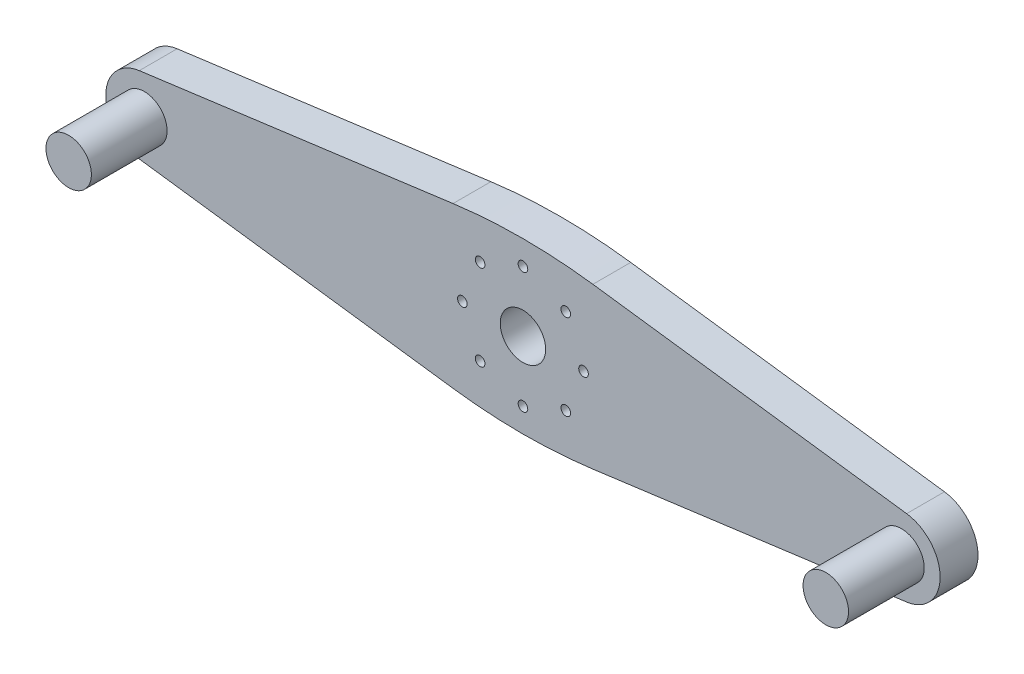
ISO-10303-21;
HEADER;
FILE_DESCRIPTION(('STEP AP214'),'2;1');
FILE_NAME('part.step','',(''),(''),'','','');
FILE_SCHEMA(('AUTOMOTIVE_DESIGN { 1 0 10303 214 1 1 1 1 }'));
ENDSEC;
DATA;
#1=APPLICATION_CONTEXT('core data for automotive mechanical design processes');
#2=APPLICATION_PROTOCOL_DEFINITION('international standard','automotive_design',2000,#1);
#3=PRODUCT_CONTEXT('',#1,'mechanical');
#4=PRODUCT('Part','Part','',(#3));
#5=PRODUCT_RELATED_PRODUCT_CATEGORY('part','',(#4));
#6=PRODUCT_DEFINITION_FORMATION('','',#4);
#7=PRODUCT_DEFINITION_CONTEXT('part definition',#1,'design');
#8=PRODUCT_DEFINITION('design','',#6,#7);
#9=PRODUCT_DEFINITION_SHAPE('','',#8);
#10=(LENGTH_UNIT() NAMED_UNIT(*) SI_UNIT(.MILLI.,.METRE.));
#11=(NAMED_UNIT(*) PLANE_ANGLE_UNIT() SI_UNIT($,.RADIAN.));
#12=(NAMED_UNIT(*) SI_UNIT($,.STERADIAN.) SOLID_ANGLE_UNIT());
#13=UNCERTAINTY_MEASURE_WITH_UNIT(LENGTH_MEASURE(1.E-05),#10,'distance_accuracy_value','');
#14=(GEOMETRIC_REPRESENTATION_CONTEXT(3) GLOBAL_UNCERTAINTY_ASSIGNED_CONTEXT((#13)) GLOBAL_UNIT_ASSIGNED_CONTEXT((#10,
#11,#12)) REPRESENTATION_CONTEXT('',''));
#15=CARTESIAN_POINT('',(0.,0.,0.));
#16=DIRECTION('',(0.,0.,1.));
#17=DIRECTION('',(1.,0.,0.));
#18=AXIS2_PLACEMENT_3D('',#15,#16,#17);
#19=CARTESIAN_POINT('',(50.,0.,5.));
#20=DIRECTION('',(0.,0.,-1.));
#21=DIRECTION('',(-1.,0.,0.));
#22=AXIS2_PLACEMENT_3D('',#19,#20,#21);
#23=PLANE('',#22);
#24=CARTESIAN_POINT('',(50.,0.,5.));
#25=DIRECTION('',(0.,0.,1.));
#26=DIRECTION('',(-1.,0.,0.));
#27=AXIS2_PLACEMENT_3D('',#24,#25,#26);
#28=CIRCLE('',#27,5.10024633771241);
#29=CARTESIAN_POINT('',(50.6728763500851,-5.05566515137672,5.));
#30=VERTEX_POINT('',#29);
#31=CARTESIAN_POINT('',(50.6728763500851,5.05566515137672,5.));
#32=VERTEX_POINT('',#31);
#33=EDGE_CURVE('E147',#30,#32,#28,.T.);
#34=ORIENTED_EDGE('',*,*,#33,.T.);
#35=DIRECTION('',(-0.991259013117456,0.131930166805804,0.));
#36=VECTOR('',#35,1.);
#37=CARTESIAN_POINT('',(50.6728763500851,5.05566515137672,5.));
#38=LINE('',#37,#36);
#39=CARTESIAN_POINT('',(9.2351116764065,10.5707637614413,5.));
#40=VERTEX_POINT('',#39);
#41=EDGE_CURVE('E95',#32,#40,#38,.T.);
#42=ORIENTED_EDGE('',*,*,#41,.T.);
#43=CARTESIAN_POINT('',(0.,-58.8173671567806,5.));
#44=DIRECTION('',(0.,0.,1.));
#45=DIRECTION('',(-1.,0.,0.));
#46=AXIS2_PLACEMENT_3D('',#43,#44,#45);
#47=CIRCLE('',#46,70.);
#48=CARTESIAN_POINT('',(-9.23511167640649,10.5707637614413,5.));
#49=VERTEX_POINT('',#48);
#50=EDGE_CURVE('E162',#40,#49,#47,.T.);
#51=ORIENTED_EDGE('',*,*,#50,.T.);
#52=DIRECTION('',(-0.991259013117456,-0.131930166805804,0.));
#53=VECTOR('',#52,1.);
#54=CARTESIAN_POINT('',(-50.6728763500851,5.05566515137672,5.));
#55=LINE('',#54,#53);
#56=CARTESIAN_POINT('',(-50.6728763500851,5.05566515137672,5.));
#57=VERTEX_POINT('',#56);
#58=EDGE_CURVE('E175',#49,#57,#55,.T.);
#59=ORIENTED_EDGE('',*,*,#58,.T.);
#60=CARTESIAN_POINT('',(-50.,0.,5.));
#61=DIRECTION('',(0.,0.,1.));
#62=DIRECTION('',(1.,0.,0.));
#63=AXIS2_PLACEMENT_3D('',#60,#61,#62);
#64=CIRCLE('',#63,5.10024633771241);
#65=CARTESIAN_POINT('',(-50.6728763500851,-5.05566515137672,5.));
#66=VERTEX_POINT('',#65);
#67=EDGE_CURVE('E114',#57,#66,#64,.T.);
#68=ORIENTED_EDGE('',*,*,#67,.T.);
#69=DIRECTION('',(0.991259013117456,-0.131930166805804,0.));
#70=VECTOR('',#69,1.);
#71=CARTESIAN_POINT('',(-50.6728763500851,-5.05566515137672,5.));
#72=LINE('',#71,#70);
#73=CARTESIAN_POINT('',(-9.23511167640653,-10.5707637614413,5.));
#74=VERTEX_POINT('',#73);
#75=EDGE_CURVE('E108',#66,#74,#72,.T.);
#76=ORIENTED_EDGE('',*,*,#75,.T.);
#77=CARTESIAN_POINT('',(0.,58.8173671567806,5.));
#78=DIRECTION('',(0.,0.,1.));
#79=DIRECTION('',(1.,0.,0.));
#80=AXIS2_PLACEMENT_3D('',#77,#78,#79);
#81=CIRCLE('',#80,70.);
#82=CARTESIAN_POINT('',(9.23511167640649,-10.5707637614413,5.));
#83=VERTEX_POINT('',#82);
#84=EDGE_CURVE('E112',#74,#83,#81,.T.);
#85=ORIENTED_EDGE('',*,*,#84,.T.);
#86=DIRECTION('',(0.991259013117456,0.131930166805804,0.));
#87=VECTOR('',#86,1.);
#88=CARTESIAN_POINT('',(50.6728763500851,-5.05566515137672,5.));
#89=LINE('',#88,#87);
#90=EDGE_CURVE('E52',#83,#30,#89,.T.);
#91=ORIENTED_EDGE('',*,*,#90,.T.);
#92=EDGE_LOOP('',(#34,#42,#51,#59,#68,#76,#85,#91));
#93=FACE_BOUND('',#92,.T.);
#94=CARTESIAN_POINT('',(0.,0.,5.));
#95=DIRECTION('',(0.,0.,1.));
#96=DIRECTION('',(1.,0.,0.));
#97=AXIS2_PLACEMENT_3D('',#94,#95,#96);
#98=CIRCLE('',#97,3.);
#99=CARTESIAN_POINT('',(3.,0.,5.));
#100=VERTEX_POINT('',#99);
#101=EDGE_CURVE('E136',#100,#100,#98,.T.);
#102=ORIENTED_EDGE('',*,*,#101,.F.);
#103=EDGE_LOOP('',(#102));
#104=FACE_BOUND('',#103,.T.);
#105=CARTESIAN_POINT('',(-8.,0.,5.));
#106=DIRECTION('',(0.,0.,1.));
#107=DIRECTION('',(1.,0.,0.));
#108=AXIS2_PLACEMENT_3D('',#105,#106,#107);
#109=CIRCLE('',#108,0.635000000000001);
#110=CARTESIAN_POINT('',(-7.365,0.,5.));
#111=VERTEX_POINT('',#110);
#112=EDGE_CURVE('E184',#111,#111,#109,.T.);
#113=ORIENTED_EDGE('',*,*,#112,.F.);
#114=EDGE_LOOP('',(#113));
#115=FACE_BOUND('',#114,.T.);
#116=CARTESIAN_POINT('',(-50.,0.,5.));
#117=DIRECTION('',(0.,0.,1.));
#118=DIRECTION('',(1.,0.,0.));
#119=AXIS2_PLACEMENT_3D('',#116,#117,#118);
#120=CIRCLE('',#119,3.);
#121=CARTESIAN_POINT('',(-47.,0.,5.));
#122=VERTEX_POINT('',#121);
#123=EDGE_CURVE('E190',#122,#122,#120,.T.);
#124=ORIENTED_EDGE('',*,*,#123,.F.);
#125=EDGE_LOOP('',(#124));
#126=FACE_BOUND('',#125,.T.);
#127=CARTESIAN_POINT('',(-5.65685424949237,5.65685424949239,5.));
#128=DIRECTION('',(0.,0.,1.));
#129=DIRECTION('',(1.,0.,0.));
#130=AXIS2_PLACEMENT_3D('',#127,#128,#129);
#131=CIRCLE('',#130,0.635000000000001);
#132=CARTESIAN_POINT('',(-5.02185424949237,5.65685424949239,5.));
#133=VERTEX_POINT('',#132);
#134=EDGE_CURVE('E195',#133,#133,#131,.T.);
#135=ORIENTED_EDGE('',*,*,#134,.F.);
#136=EDGE_LOOP('',(#135));
#137=FACE_BOUND('',#136,.T.);
#138=CARTESIAN_POINT('',(0.,8.,5.));
#139=DIRECTION('',(0.,0.,1.));
#140=DIRECTION('',(1.,0.,0.));
#141=AXIS2_PLACEMENT_3D('',#138,#139,#140);
#142=CIRCLE('',#141,0.635000000000001);
#143=CARTESIAN_POINT('',(0.63500000000003,8.,5.));
#144=VERTEX_POINT('',#143);
#145=EDGE_CURVE('E199',#144,#144,#142,.T.);
#146=ORIENTED_EDGE('',*,*,#145,.F.);
#147=EDGE_LOOP('',(#146));
#148=FACE_BOUND('',#147,.T.);
#149=CARTESIAN_POINT('',(50.,0.,5.));
#150=DIRECTION('',(0.,0.,1.));
#151=DIRECTION('',(-1.,0.,0.));
#152=AXIS2_PLACEMENT_3D('',#149,#150,#151);
#153=CIRCLE('',#152,3.);
#154=CARTESIAN_POINT('',(47.,0.,5.));
#155=VERTEX_POINT('',#154);
#156=EDGE_CURVE('E205',#155,#155,#153,.T.);
#157=ORIENTED_EDGE('',*,*,#156,.F.);
#158=EDGE_LOOP('',(#157));
#159=FACE_BOUND('',#158,.T.);
#160=CARTESIAN_POINT('',(5.65685424949241,5.65685424949235,5.));
#161=DIRECTION('',(0.,0.,1.));
#162=DIRECTION('',(1.,0.,0.));
#163=AXIS2_PLACEMENT_3D('',#160,#161,#162);
#164=CIRCLE('',#163,0.635);
#165=CARTESIAN_POINT('',(6.29185424949241,5.65685424949235,5.));
#166=VERTEX_POINT('',#165);
#167=EDGE_CURVE('E210',#166,#166,#164,.T.);
#168=ORIENTED_EDGE('',*,*,#167,.F.);
#169=EDGE_LOOP('',(#168));
#170=FACE_BOUND('',#169,.T.);
#171=CARTESIAN_POINT('',(8.,0.,5.));
#172=DIRECTION('',(0.,0.,1.));
#173=DIRECTION('',(1.,0.,0.));
#174=AXIS2_PLACEMENT_3D('',#171,#172,#173);
#175=CIRCLE('',#174,0.635);
#176=CARTESIAN_POINT('',(8.635,0.,5.));
#177=VERTEX_POINT('',#176);
#178=EDGE_CURVE('E214',#177,#177,#175,.T.);
#179=ORIENTED_EDGE('',*,*,#178,.F.);
#180=EDGE_LOOP('',(#179));
#181=FACE_BOUND('',#180,.T.);
#182=CARTESIAN_POINT('',(5.65685424949233,-5.65685424949243,5.));
#183=DIRECTION('',(0.,0.,1.));
#184=DIRECTION('',(1.,0.,0.));
#185=AXIS2_PLACEMENT_3D('',#182,#183,#184);
#186=CIRCLE('',#185,0.635000000000001);
#187=CARTESIAN_POINT('',(6.29185424949233,-5.65685424949243,5.));
#188=VERTEX_POINT('',#187);
#189=EDGE_CURVE('E220',#188,#188,#186,.T.);
#190=ORIENTED_EDGE('',*,*,#189,.F.);
#191=EDGE_LOOP('',(#190));
#192=FACE_BOUND('',#191,.T.);
#193=CARTESIAN_POINT('',(0.,-8.,5.));
#194=DIRECTION('',(0.,0.,1.));
#195=DIRECTION('',(1.,0.,0.));
#196=AXIS2_PLACEMENT_3D('',#193,#194,#195);
#197=CIRCLE('',#196,0.635);
#198=CARTESIAN_POINT('',(0.634999999999915,-8.,5.));
#199=VERTEX_POINT('',#198);
#200=EDGE_CURVE('E226',#199,#199,#197,.T.);
#201=ORIENTED_EDGE('',*,*,#200,.F.);
#202=EDGE_LOOP('',(#201));
#203=FACE_BOUND('',#202,.T.);
#204=CARTESIAN_POINT('',(-5.65685424949245,-5.65685424949231,5.));
#205=DIRECTION('',(0.,0.,1.));
#206=DIRECTION('',(1.,0.,0.));
#207=AXIS2_PLACEMENT_3D('',#204,#205,#206);
#208=CIRCLE('',#207,0.635);
#209=CARTESIAN_POINT('',(-5.02185424949245,-5.65685424949231,5.));
#210=VERTEX_POINT('',#209);
#211=EDGE_CURVE('E232',#210,#210,#208,.T.);
#212=ORIENTED_EDGE('',*,*,#211,.F.);
#213=EDGE_LOOP('',(#212));
#214=FACE_BOUND('',#213,.T.);
#215=ADVANCED_FACE('F35',(#93,#104,#115,#126,#137,#148,#159,#170,#181,#192,#203,#214),#23,.F.);
#216=CARTESIAN_POINT('',(50.,0.,0.));
#217=DIRECTION('',(0.,0.,-1.));
#218=DIRECTION('',(-1.,0.,0.));
#219=AXIS2_PLACEMENT_3D('',#216,#217,#218);
#220=PLANE('',#219);
#221=CARTESIAN_POINT('',(0.,-8.,0.));
#222=DIRECTION('',(0.,0.,1.));
#223=DIRECTION('',(1.,0.,0.));
#224=AXIS2_PLACEMENT_3D('',#221,#222,#223);
#225=CIRCLE('',#224,0.635);
#226=CARTESIAN_POINT('',(0.634999999999915,-8.,0.));
#227=VERTEX_POINT('',#226);
#228=EDGE_CURVE('E229',#227,#227,#225,.T.);
#229=ORIENTED_EDGE('',*,*,#228,.T.);
#230=EDGE_LOOP('',(#229));
#231=FACE_BOUND('',#230,.T.);
#232=CARTESIAN_POINT('',(8.,0.,0.));
#233=DIRECTION('',(0.,0.,1.));
#234=DIRECTION('',(1.,0.,0.));
#235=AXIS2_PLACEMENT_3D('',#232,#233,#234);
#236=CIRCLE('',#235,0.635);
#237=CARTESIAN_POINT('',(8.635,0.,0.));
#238=VERTEX_POINT('',#237);
#239=EDGE_CURVE('E217',#238,#238,#236,.T.);
#240=ORIENTED_EDGE('',*,*,#239,.T.);
#241=EDGE_LOOP('',(#240));
#242=FACE_BOUND('',#241,.T.);
#243=CARTESIAN_POINT('',(-5.65685424949237,5.65685424949239,0.));
#244=DIRECTION('',(0.,0.,1.));
#245=DIRECTION('',(1.,0.,0.));
#246=AXIS2_PLACEMENT_3D('',#243,#244,#245);
#247=CIRCLE('',#246,0.635000000000001);
#248=CARTESIAN_POINT('',(-5.02185424949237,5.65685424949239,0.));
#249=VERTEX_POINT('',#248);
#250=EDGE_CURVE('E196',#249,#249,#247,.T.);
#251=ORIENTED_EDGE('',*,*,#250,.T.);
#252=EDGE_LOOP('',(#251));
#253=FACE_BOUND('',#252,.T.);
#254=CARTESIAN_POINT('',(-8.,0.,0.));
#255=DIRECTION('',(0.,0.,1.));
#256=DIRECTION('',(1.,0.,0.));
#257=AXIS2_PLACEMENT_3D('',#254,#255,#256);
#258=CIRCLE('',#257,0.635000000000001);
#259=CARTESIAN_POINT('',(-7.365,0.,0.));
#260=VERTEX_POINT('',#259);
#261=EDGE_CURVE('E187',#260,#260,#258,.T.);
#262=ORIENTED_EDGE('',*,*,#261,.T.);
#263=EDGE_LOOP('',(#262));
#264=FACE_BOUND('',#263,.T.);
#265=CARTESIAN_POINT('',(50.,0.,0.));
#266=DIRECTION('',(0.,0.,1.));
#267=DIRECTION('',(-1.,0.,0.));
#268=AXIS2_PLACEMENT_3D('',#265,#266,#267);
#269=CIRCLE('',#268,5.10024633771241);
#270=CARTESIAN_POINT('',(50.6728763500851,-5.05566515137672,0.));
#271=VERTEX_POINT('',#270);
#272=CARTESIAN_POINT('',(50.6728763500851,5.05566515137672,0.));
#273=VERTEX_POINT('',#272);
#274=EDGE_CURVE('E132',#271,#273,#269,.T.);
#275=ORIENTED_EDGE('',*,*,#274,.F.);
#276=DIRECTION('',(0.991259013117456,0.131930166805804,0.));
#277=VECTOR('',#276,1.);
#278=CARTESIAN_POINT('',(50.6728763500851,-5.05566515137672,0.));
#279=LINE('',#278,#277);
#280=CARTESIAN_POINT('',(9.23511167640649,-10.5707637614413,0.));
#281=VERTEX_POINT('',#280);
#282=EDGE_CURVE('E87',#281,#271,#279,.T.);
#283=ORIENTED_EDGE('',*,*,#282,.F.);
#284=CARTESIAN_POINT('',(0.,58.8173671567806,0.));
#285=DIRECTION('',(0.,0.,1.));
#286=DIRECTION('',(1.,0.,0.));
#287=AXIS2_PLACEMENT_3D('',#284,#285,#286);
#288=CIRCLE('',#287,70.);
#289=CARTESIAN_POINT('',(-9.23511167640653,-10.5707637614413,0.));
#290=VERTEX_POINT('',#289);
#291=EDGE_CURVE('E81',#290,#281,#288,.T.);
#292=ORIENTED_EDGE('',*,*,#291,.F.);
#293=DIRECTION('',(0.991259013117456,-0.131930166805804,0.));
#294=VECTOR('',#293,1.);
#295=CARTESIAN_POINT('',(-50.6728763500851,-5.05566515137672,0.));
#296=LINE('',#295,#294);
#297=CARTESIAN_POINT('',(-50.6728763500851,-5.05566515137672,0.));
#298=VERTEX_POINT('',#297);
#299=EDGE_CURVE('E122',#298,#290,#296,.T.);
#300=ORIENTED_EDGE('',*,*,#299,.F.);
#301=CARTESIAN_POINT('',(-50.,0.,0.));
#302=DIRECTION('',(0.,0.,1.));
#303=DIRECTION('',(1.,0.,0.));
#304=AXIS2_PLACEMENT_3D('',#301,#302,#303);
#305=CIRCLE('',#304,5.10024633771241);
#306=CARTESIAN_POINT('',(-50.6728763500851,5.05566515137672,0.));
#307=VERTEX_POINT('',#306);
#308=EDGE_CURVE('E142',#307,#298,#305,.T.);
#309=ORIENTED_EDGE('',*,*,#308,.F.);
#310=DIRECTION('',(-0.991259013117456,-0.131930166805804,0.));
#311=VECTOR('',#310,1.);
#312=CARTESIAN_POINT('',(-50.6728763500851,5.05566515137672,0.));
#313=LINE('',#312,#311);
#314=CARTESIAN_POINT('',(-9.23511167640649,10.5707637614413,0.));
#315=VERTEX_POINT('',#314);
#316=EDGE_CURVE('E140',#315,#307,#313,.T.);
#317=ORIENTED_EDGE('',*,*,#316,.F.);
#318=CARTESIAN_POINT('',(0.,-58.8173671567806,0.));
#319=DIRECTION('',(0.,0.,1.));
#320=DIRECTION('',(-1.,0.,0.));
#321=AXIS2_PLACEMENT_3D('',#318,#319,#320);
#322=CIRCLE('',#321,70.);
#323=CARTESIAN_POINT('',(9.2351116764065,10.5707637614413,0.));
#324=VERTEX_POINT('',#323);
#325=EDGE_CURVE('E138',#324,#315,#322,.T.);
#326=ORIENTED_EDGE('',*,*,#325,.F.);
#327=DIRECTION('',(-0.991259013117456,0.131930166805804,0.));
#328=VECTOR('',#327,1.);
#329=CARTESIAN_POINT('',(50.6728763500851,5.05566515137672,0.));
#330=LINE('',#329,#328);
#331=EDGE_CURVE('E135',#273,#324,#330,.T.);
#332=ORIENTED_EDGE('',*,*,#331,.F.);
#333=EDGE_LOOP('',(#275,#283,#292,#300,#309,#317,#326,#332));
#334=FACE_BOUND('',#333,.T.);
#335=CARTESIAN_POINT('',(0.,0.,0.));
#336=DIRECTION('',(0.,0.,1.));
#337=DIRECTION('',(1.,0.,0.));
#338=AXIS2_PLACEMENT_3D('',#335,#336,#337);
#339=CIRCLE('',#338,3.);
#340=CARTESIAN_POINT('',(3.,0.,0.));
#341=VERTEX_POINT('',#340);
#342=EDGE_CURVE('E181',#341,#341,#339,.T.);
#343=ORIENTED_EDGE('',*,*,#342,.T.);
#344=EDGE_LOOP('',(#343));
#345=FACE_BOUND('',#344,.T.);
#346=CARTESIAN_POINT('',(0.,8.,0.));
#347=DIRECTION('',(0.,0.,1.));
#348=DIRECTION('',(1.,0.,0.));
#349=AXIS2_PLACEMENT_3D('',#346,#347,#348);
#350=CIRCLE('',#349,0.635000000000001);
#351=CARTESIAN_POINT('',(0.63500000000003,8.,0.));
#352=VERTEX_POINT('',#351);
#353=EDGE_CURVE('E202',#352,#352,#350,.T.);
#354=ORIENTED_EDGE('',*,*,#353,.T.);
#355=EDGE_LOOP('',(#354));
#356=FACE_BOUND('',#355,.T.);
#357=CARTESIAN_POINT('',(5.65685424949241,5.65685424949235,0.));
#358=DIRECTION('',(0.,0.,1.));
#359=DIRECTION('',(1.,0.,0.));
#360=AXIS2_PLACEMENT_3D('',#357,#358,#359);
#361=CIRCLE('',#360,0.635);
#362=CARTESIAN_POINT('',(6.29185424949241,5.65685424949235,0.));
#363=VERTEX_POINT('',#362);
#364=EDGE_CURVE('E211',#363,#363,#361,.T.);
#365=ORIENTED_EDGE('',*,*,#364,.T.);
#366=EDGE_LOOP('',(#365));
#367=FACE_BOUND('',#366,.T.);
#368=CARTESIAN_POINT('',(5.65685424949233,-5.65685424949243,0.));
#369=DIRECTION('',(0.,0.,1.));
#370=DIRECTION('',(1.,0.,0.));
#371=AXIS2_PLACEMENT_3D('',#368,#369,#370);
#372=CIRCLE('',#371,0.635000000000001);
#373=CARTESIAN_POINT('',(6.29185424949233,-5.65685424949243,0.));
#374=VERTEX_POINT('',#373);
#375=EDGE_CURVE('E223',#374,#374,#372,.T.);
#376=ORIENTED_EDGE('',*,*,#375,.T.);
#377=EDGE_LOOP('',(#376));
#378=FACE_BOUND('',#377,.T.);
#379=CARTESIAN_POINT('',(-5.65685424949245,-5.65685424949231,0.));
#380=DIRECTION('',(0.,0.,1.));
#381=DIRECTION('',(1.,0.,0.));
#382=AXIS2_PLACEMENT_3D('',#379,#380,#381);
#383=CIRCLE('',#382,0.635);
#384=CARTESIAN_POINT('',(-5.02185424949245,-5.65685424949231,0.));
#385=VERTEX_POINT('',#384);
#386=EDGE_CURVE('E235',#385,#385,#383,.T.);
#387=ORIENTED_EDGE('',*,*,#386,.T.);
#388=EDGE_LOOP('',(#387));
#389=FACE_BOUND('',#388,.T.);
#390=ADVANCED_FACE('F166',(#231,#242,#253,#264,#334,#345,#356,#367,#378,#389),#220,.T.);
#391=CARTESIAN_POINT('',(50.,0.,5.));
#392=DIRECTION('',(0.,0.,-1.));
#393=DIRECTION('',(-1.,0.,0.));
#394=AXIS2_PLACEMENT_3D('',#391,#392,#393);
#395=CYLINDRICAL_SURFACE('',#394,5.10024633771241);
#396=ORIENTED_EDGE('',*,*,#274,.T.);
#397=DIRECTION('',(0.,0.,-1.));
#398=VECTOR('',#397,1.);
#399=CARTESIAN_POINT('',(50.6728763500851,5.05566515137672,5.));
#400=LINE('',#399,#398);
#401=EDGE_CURVE('E11',#32,#273,#400,.T.);
#402=ORIENTED_EDGE('',*,*,#401,.F.);
#403=ORIENTED_EDGE('',*,*,#33,.F.);
#404=DIRECTION('',(0.,0.,-1.));
#405=VECTOR('',#404,1.);
#406=CARTESIAN_POINT('',(50.6728763500851,-5.05566515137672,5.));
#407=LINE('',#406,#405);
#408=EDGE_CURVE('E128',#30,#271,#407,.T.);
#409=ORIENTED_EDGE('',*,*,#408,.T.);
#410=EDGE_LOOP('',(#396,#402,#403,#409));
#411=FACE_BOUND('',#410,.T.);
#412=ADVANCED_FACE('F37',(#411),#395,.T.);
#413=CARTESIAN_POINT('',(50.6728763500851,5.05566515137672,5.));
#414=DIRECTION('',(-0.131930166805804,-0.991259013117456,0.));
#415=DIRECTION('',(0.991259013117456,-0.131930166805804,0.));
#416=AXIS2_PLACEMENT_3D('',#413,#414,#415);
#417=PLANE('',#416);
#418=ORIENTED_EDGE('',*,*,#331,.T.);
#419=DIRECTION('',(0.,0.,-1.));
#420=VECTOR('',#419,1.);
#421=CARTESIAN_POINT('',(9.2351116764065,10.5707637614413,5.));
#422=LINE('',#421,#420);
#423=EDGE_CURVE('E44',#40,#324,#422,.T.);
#424=ORIENTED_EDGE('',*,*,#423,.F.);
#425=ORIENTED_EDGE('',*,*,#41,.F.);
#426=ORIENTED_EDGE('',*,*,#401,.T.);
#427=EDGE_LOOP('',(#418,#424,#425,#426));
#428=FACE_BOUND('',#427,.T.);
#429=ADVANCED_FACE('F281',(#428),#417,.F.);
#430=CARTESIAN_POINT('',(0.,-58.8173671567806,5.));
#431=DIRECTION('',(0.,0.,-1.));
#432=DIRECTION('',(-1.,0.,0.));
#433=AXIS2_PLACEMENT_3D('',#430,#431,#432);
#434=CYLINDRICAL_SURFACE('',#433,70.);
#435=ORIENTED_EDGE('',*,*,#325,.T.);
#436=DIRECTION('',(0.,0.,-1.));
#437=VECTOR('',#436,1.);
#438=CARTESIAN_POINT('',(-9.23511167640649,10.5707637614413,5.));
#439=LINE('',#438,#437);
#440=EDGE_CURVE('E154',#49,#315,#439,.T.);
#441=ORIENTED_EDGE('',*,*,#440,.F.);
#442=ORIENTED_EDGE('',*,*,#50,.F.);
#443=ORIENTED_EDGE('',*,*,#423,.T.);
#444=EDGE_LOOP('',(#435,#441,#442,#443));
#445=FACE_BOUND('',#444,.T.);
#446=ADVANCED_FACE('F160',(#445),#434,.T.);
#447=CARTESIAN_POINT('',(-50.6728763500851,5.05566515137672,5.));
#448=DIRECTION('',(0.131930166805804,-0.991259013117456,0.));
#449=DIRECTION('',(0.991259013117456,0.131930166805804,0.));
#450=AXIS2_PLACEMENT_3D('',#447,#448,#449);
#451=PLANE('',#450);
#452=ORIENTED_EDGE('',*,*,#316,.T.);
#453=DIRECTION('',(0.,0.,-1.));
#454=VECTOR('',#453,1.);
#455=CARTESIAN_POINT('',(-50.6728763500851,5.05566515137672,5.));
#456=LINE('',#455,#454);
#457=EDGE_CURVE('E151',#57,#307,#456,.T.);
#458=ORIENTED_EDGE('',*,*,#457,.F.);
#459=ORIENTED_EDGE('',*,*,#58,.F.);
#460=ORIENTED_EDGE('',*,*,#440,.T.);
#461=EDGE_LOOP('',(#452,#458,#459,#460));
#462=FACE_BOUND('',#461,.T.);
#463=ADVANCED_FACE('F171',(#462),#451,.F.);
#464=CARTESIAN_POINT('',(-50.,0.,5.));
#465=DIRECTION('',(0.,0.,-1.));
#466=DIRECTION('',(-1.,0.,0.));
#467=AXIS2_PLACEMENT_3D('',#464,#465,#466);
#468=CYLINDRICAL_SURFACE('',#467,5.10024633771241);
#469=ORIENTED_EDGE('',*,*,#308,.T.);
#470=DIRECTION('',(0.,0.,-1.));
#471=VECTOR('',#470,1.);
#472=CARTESIAN_POINT('',(-50.6728763500851,-5.05566515137672,5.));
#473=LINE('',#472,#471);
#474=EDGE_CURVE('E123',#66,#298,#473,.T.);
#475=ORIENTED_EDGE('',*,*,#474,.F.);
#476=ORIENTED_EDGE('',*,*,#67,.F.);
#477=ORIENTED_EDGE('',*,*,#457,.T.);
#478=EDGE_LOOP('',(#469,#475,#476,#477));
#479=FACE_BOUND('',#478,.T.);
#480=ADVANCED_FACE('F174',(#479),#468,.T.);
#481=CARTESIAN_POINT('',(-50.6728763500851,-5.05566515137672,5.));
#482=DIRECTION('',(0.131930166805804,0.991259013117456,0.));
#483=DIRECTION('',(-0.991259013117456,0.131930166805804,0.));
#484=AXIS2_PLACEMENT_3D('',#481,#482,#483);
#485=PLANE('',#484);
#486=ORIENTED_EDGE('',*,*,#299,.T.);
#487=DIRECTION('',(0.,0.,-1.));
#488=VECTOR('',#487,1.);
#489=CARTESIAN_POINT('',(-9.23511167640653,-10.5707637614413,5.));
#490=LINE('',#489,#488);
#491=EDGE_CURVE('E119',#74,#290,#490,.T.);
#492=ORIENTED_EDGE('',*,*,#491,.F.);
#493=ORIENTED_EDGE('',*,*,#75,.F.);
#494=ORIENTED_EDGE('',*,*,#474,.T.);
#495=EDGE_LOOP('',(#486,#492,#493,#494));
#496=FACE_BOUND('',#495,.T.);
#497=ADVANCED_FACE('F120',(#496),#485,.F.);
#498=CARTESIAN_POINT('',(0.,58.8173671567806,5.));
#499=DIRECTION('',(0.,0.,-1.));
#500=DIRECTION('',(-1.,0.,0.));
#501=AXIS2_PLACEMENT_3D('',#498,#499,#500);
#502=CYLINDRICAL_SURFACE('',#501,70.);
#503=ORIENTED_EDGE('',*,*,#291,.T.);
#504=DIRECTION('',(0.,0.,-1.));
#505=VECTOR('',#504,1.);
#506=CARTESIAN_POINT('',(9.23511167640649,-10.5707637614413,5.));
#507=LINE('',#506,#505);
#508=EDGE_CURVE('E124',#83,#281,#507,.T.);
#509=ORIENTED_EDGE('',*,*,#508,.F.);
#510=ORIENTED_EDGE('',*,*,#84,.F.);
#511=ORIENTED_EDGE('',*,*,#491,.T.);
#512=EDGE_LOOP('',(#503,#509,#510,#511));
#513=FACE_BOUND('',#512,.T.);
#514=ADVANCED_FACE('F126',(#513),#502,.T.);
#515=CARTESIAN_POINT('',(50.6728763500851,-5.05566515137672,5.));
#516=DIRECTION('',(-0.131930166805804,0.991259013117456,0.));
#517=DIRECTION('',(-0.991259013117456,-0.131930166805804,0.));
#518=AXIS2_PLACEMENT_3D('',#515,#516,#517);
#519=PLANE('',#518);
#520=ORIENTED_EDGE('',*,*,#282,.T.);
#521=ORIENTED_EDGE('',*,*,#408,.F.);
#522=ORIENTED_EDGE('',*,*,#90,.F.);
#523=ORIENTED_EDGE('',*,*,#508,.T.);
#524=EDGE_LOOP('',(#520,#521,#522,#523));
#525=FACE_BOUND('',#524,.T.);
#526=ADVANCED_FACE('F269',(#525),#519,.F.);
#527=CARTESIAN_POINT('',(0.,0.,5.));
#528=DIRECTION('',(0.,0.,-1.));
#529=DIRECTION('',(-1.,0.,0.));
#530=AXIS2_PLACEMENT_3D('',#527,#528,#529);
#531=CYLINDRICAL_SURFACE('',#530,3.);
#532=ORIENTED_EDGE('',*,*,#101,.T.);
#533=EDGE_LOOP('',(#532));
#534=FACE_BOUND('',#533,.T.);
#535=ORIENTED_EDGE('',*,*,#342,.F.);
#536=EDGE_LOOP('',(#535));
#537=FACE_BOUND('',#536,.T.);
#538=ADVANCED_FACE('F266',(#534,#537),#531,.F.);
#539=CARTESIAN_POINT('',(-8.,0.,5.));
#540=DIRECTION('',(0.,0.,-1.));
#541=DIRECTION('',(-1.,0.,0.));
#542=AXIS2_PLACEMENT_3D('',#539,#540,#541);
#543=CYLINDRICAL_SURFACE('',#542,0.635000000000001);
#544=ORIENTED_EDGE('',*,*,#112,.T.);
#545=EDGE_LOOP('',(#544));
#546=FACE_BOUND('',#545,.T.);
#547=ORIENTED_EDGE('',*,*,#261,.F.);
#548=EDGE_LOOP('',(#547));
#549=FACE_BOUND('',#548,.T.);
#550=ADVANCED_FACE('F360',(#546,#549),#543,.F.);
#551=CARTESIAN_POINT('',(-5.65685424949237,5.65685424949239,5.));
#552=DIRECTION('',(0.,0.,-1.));
#553=DIRECTION('',(-1.,0.,0.));
#554=AXIS2_PLACEMENT_3D('',#551,#552,#553);
#555=CYLINDRICAL_SURFACE('',#554,0.635000000000001);
#556=ORIENTED_EDGE('',*,*,#134,.T.);
#557=EDGE_LOOP('',(#556));
#558=FACE_BOUND('',#557,.T.);
#559=ORIENTED_EDGE('',*,*,#250,.F.);
#560=EDGE_LOOP('',(#559));
#561=FACE_BOUND('',#560,.T.);
#562=ADVANCED_FACE('F357',(#558,#561),#555,.F.);
#563=CARTESIAN_POINT('',(0.,8.,5.));
#564=DIRECTION('',(0.,0.,-1.));
#565=DIRECTION('',(-1.,0.,0.));
#566=AXIS2_PLACEMENT_3D('',#563,#564,#565);
#567=CYLINDRICAL_SURFACE('',#566,0.635000000000001);
#568=ORIENTED_EDGE('',*,*,#145,.T.);
#569=EDGE_LOOP('',(#568));
#570=FACE_BOUND('',#569,.T.);
#571=ORIENTED_EDGE('',*,*,#353,.F.);
#572=EDGE_LOOP('',(#571));
#573=FACE_BOUND('',#572,.T.);
#574=ADVANCED_FACE('F353',(#570,#573),#567,.F.);
#575=CARTESIAN_POINT('',(5.65685424949241,5.65685424949235,5.));
#576=DIRECTION('',(0.,0.,-1.));
#577=DIRECTION('',(-1.,0.,0.));
#578=AXIS2_PLACEMENT_3D('',#575,#576,#577);
#579=CYLINDRICAL_SURFACE('',#578,0.635);
#580=ORIENTED_EDGE('',*,*,#167,.T.);
#581=EDGE_LOOP('',(#580));
#582=FACE_BOUND('',#581,.T.);
#583=ORIENTED_EDGE('',*,*,#364,.F.);
#584=EDGE_LOOP('',(#583));
#585=FACE_BOUND('',#584,.T.);
#586=ADVANCED_FACE('F349',(#582,#585),#579,.F.);
#587=CARTESIAN_POINT('',(8.,0.,5.));
#588=DIRECTION('',(0.,0.,-1.));
#589=DIRECTION('',(-1.,0.,0.));
#590=AXIS2_PLACEMENT_3D('',#587,#588,#589);
#591=CYLINDRICAL_SURFACE('',#590,0.635);
#592=ORIENTED_EDGE('',*,*,#178,.T.);
#593=EDGE_LOOP('',(#592));
#594=FACE_BOUND('',#593,.T.);
#595=ORIENTED_EDGE('',*,*,#239,.F.);
#596=EDGE_LOOP('',(#595));
#597=FACE_BOUND('',#596,.T.);
#598=ADVANCED_FACE('F345',(#594,#597),#591,.F.);
#599=CARTESIAN_POINT('',(5.65685424949233,-5.65685424949243,5.));
#600=DIRECTION('',(0.,0.,-1.));
#601=DIRECTION('',(-1.,0.,0.));
#602=AXIS2_PLACEMENT_3D('',#599,#600,#601);
#603=CYLINDRICAL_SURFACE('',#602,0.635000000000001);
#604=ORIENTED_EDGE('',*,*,#189,.T.);
#605=EDGE_LOOP('',(#604));
#606=FACE_BOUND('',#605,.T.);
#607=ORIENTED_EDGE('',*,*,#375,.F.);
#608=EDGE_LOOP('',(#607));
#609=FACE_BOUND('',#608,.T.);
#610=ADVANCED_FACE('F341',(#606,#609),#603,.F.);
#611=CARTESIAN_POINT('',(0.,-8.,5.));
#612=DIRECTION('',(0.,0.,-1.));
#613=DIRECTION('',(-1.,0.,0.));
#614=AXIS2_PLACEMENT_3D('',#611,#612,#613);
#615=CYLINDRICAL_SURFACE('',#614,0.635);
#616=ORIENTED_EDGE('',*,*,#200,.T.);
#617=EDGE_LOOP('',(#616));
#618=FACE_BOUND('',#617,.T.);
#619=ORIENTED_EDGE('',*,*,#228,.F.);
#620=EDGE_LOOP('',(#619));
#621=FACE_BOUND('',#620,.T.);
#622=ADVANCED_FACE('F337',(#618,#621),#615,.F.);
#623=CARTESIAN_POINT('',(-5.65685424949245,-5.65685424949231,5.));
#624=DIRECTION('',(0.,0.,-1.));
#625=DIRECTION('',(-1.,0.,0.));
#626=AXIS2_PLACEMENT_3D('',#623,#624,#625);
#627=CYLINDRICAL_SURFACE('',#626,0.635);
#628=ORIENTED_EDGE('',*,*,#211,.T.);
#629=EDGE_LOOP('',(#628));
#630=FACE_BOUND('',#629,.T.);
#631=ORIENTED_EDGE('',*,*,#386,.F.);
#632=EDGE_LOOP('',(#631));
#633=FACE_BOUND('',#632,.T.);
#634=ADVANCED_FACE('F303',(#630,#633),#627,.F.);
#635=CARTESIAN_POINT('',(-50.,0.,15.));
#636=DIRECTION('',(0.,0.,-1.));
#637=DIRECTION('',(-1.,0.,0.));
#638=AXIS2_PLACEMENT_3D('',#635,#636,#637);
#639=CYLINDRICAL_SURFACE('',#638,3.);
#640=CARTESIAN_POINT('',(-50.,0.,15.));
#641=DIRECTION('',(0.,0.,1.));
#642=DIRECTION('',(1.,0.,0.));
#643=AXIS2_PLACEMENT_3D('',#640,#641,#642);
#644=CIRCLE('',#643,3.);
#645=CARTESIAN_POINT('',(-47.,0.,15.));
#646=VERTEX_POINT('',#645);
#647=EDGE_CURVE('E238',#646,#646,#644,.T.);
#648=ORIENTED_EDGE('',*,*,#647,.F.);
#649=EDGE_LOOP('',(#648));
#650=FACE_BOUND('',#649,.T.);
#651=ORIENTED_EDGE('',*,*,#123,.T.);
#652=EDGE_LOOP('',(#651));
#653=FACE_BOUND('',#652,.T.);
#654=ADVANCED_FACE('F308',(#650,#653),#639,.T.);
#655=CARTESIAN_POINT('',(0.,0.,15.));
#656=DIRECTION('',(0.,0.,1.));
#657=DIRECTION('',(1.,0.,0.));
#658=AXIS2_PLACEMENT_3D('',#655,#656,#657);
#659=PLANE('',#658);
#660=ORIENTED_EDGE('',*,*,#647,.T.);
#661=EDGE_LOOP('',(#660));
#662=FACE_BOUND('',#661,.T.);
#663=ADVANCED_FACE('F256',(#662),#659,.T.);
#664=CARTESIAN_POINT('',(50.,0.,15.));
#665=DIRECTION('',(0.,0.,-1.));
#666=DIRECTION('',(-1.,0.,0.));
#667=AXIS2_PLACEMENT_3D('',#664,#665,#666);
#668=CYLINDRICAL_SURFACE('',#667,3.);
#669=CARTESIAN_POINT('',(50.,0.,15.));
#670=DIRECTION('',(0.,0.,1.));
#671=DIRECTION('',(1.,0.,0.));
#672=AXIS2_PLACEMENT_3D('',#669,#670,#671);
#673=CIRCLE('',#672,3.);
#674=CARTESIAN_POINT('',(53.,0.,15.));
#675=VERTEX_POINT('',#674);
#676=EDGE_CURVE('E243',#675,#675,#673,.F.);
#677=ORIENTED_EDGE('',*,*,#676,.T.);
#678=EDGE_LOOP('',(#677));
#679=FACE_BOUND('',#678,.T.);
#680=ORIENTED_EDGE('',*,*,#156,.T.);
#681=EDGE_LOOP('',(#680));
#682=FACE_BOUND('',#681,.T.);
#683=ADVANCED_FACE('F247',(#679,#682),#668,.T.);
#684=CARTESIAN_POINT('',(0.,0.,15.));
#685=DIRECTION('',(0.,0.,1.));
#686=DIRECTION('',(1.,0.,0.));
#687=AXIS2_PLACEMENT_3D('',#684,#685,#686);
#688=PLANE('',#687);
#689=ORIENTED_EDGE('',*,*,#676,.F.);
#690=EDGE_LOOP('',(#689));
#691=FACE_BOUND('',#690,.T.);
#692=ADVANCED_FACE('F250',(#691),#688,.T.);
#693=CLOSED_SHELL('',(#215,#390,#412,#429,#446,#463,#480,#497,#514,#526,#538,#550,#562,#574,
#586,#598,#610,#622,#634,#654,#663,#683,#692));
#694=MANIFOLD_SOLID_BREP('B2',#693);
#695=ADVANCED_BREP_SHAPE_REPRESENTATION('',(#18,#694),#14);
#696=SHAPE_DEFINITION_REPRESENTATION(#9,#695);
ENDSEC;
END-ISO-10303-21;
